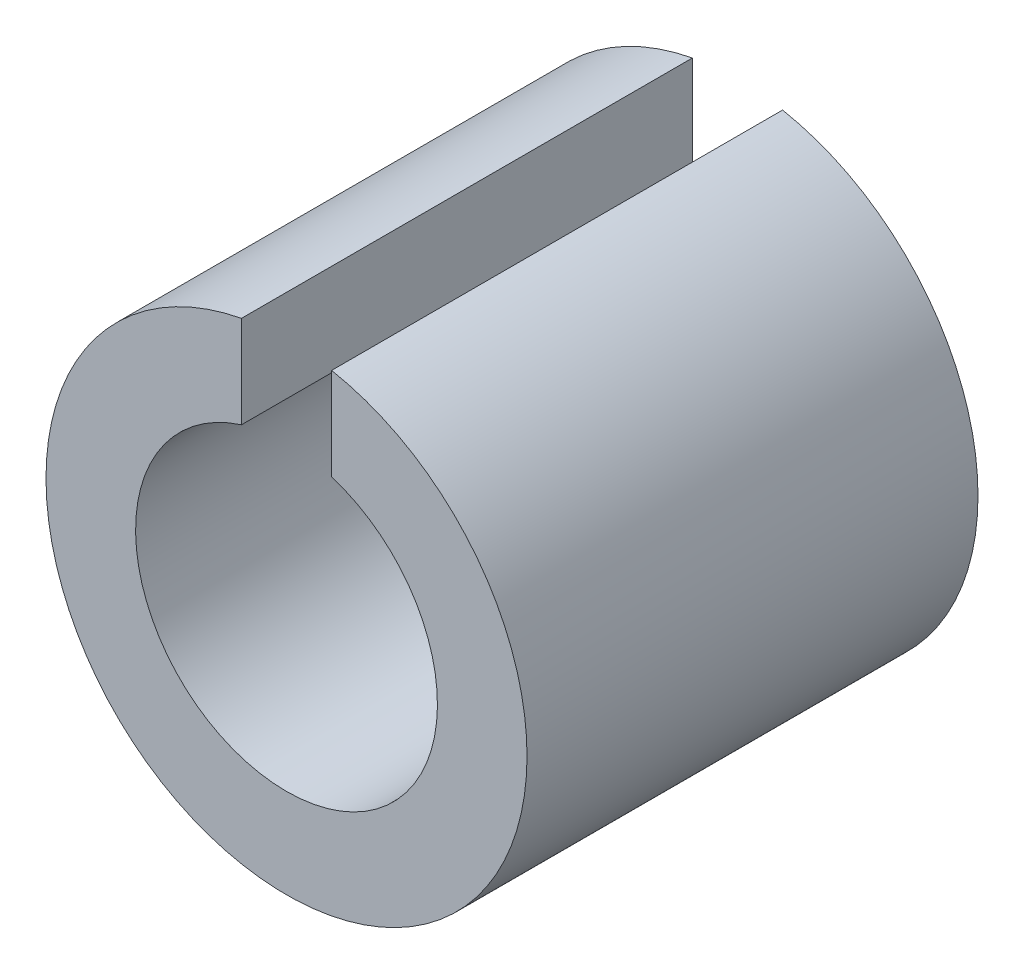
ISO-10303-21;
HEADER;
FILE_DESCRIPTION(('STEP AP214'),'2;1');
FILE_NAME('part.step','',(''),(''),'','','');
FILE_SCHEMA(('AUTOMOTIVE_DESIGN { 1 0 10303 214 1 1 1 1 }'));
ENDSEC;
DATA;
#1=APPLICATION_CONTEXT('core data for automotive mechanical design processes');
#2=APPLICATION_PROTOCOL_DEFINITION('international standard','automotive_design',2000,#1);
#3=PRODUCT_CONTEXT('',#1,'mechanical');
#4=PRODUCT('Part','Part','',(#3));
#5=PRODUCT_RELATED_PRODUCT_CATEGORY('part','',(#4));
#6=PRODUCT_DEFINITION_FORMATION('','',#4);
#7=PRODUCT_DEFINITION_CONTEXT('part definition',#1,'design');
#8=PRODUCT_DEFINITION('design','',#6,#7);
#9=PRODUCT_DEFINITION_SHAPE('','',#8);
#10=(LENGTH_UNIT() NAMED_UNIT(*) SI_UNIT(.MILLI.,.METRE.));
#11=(NAMED_UNIT(*) PLANE_ANGLE_UNIT() SI_UNIT($,.RADIAN.));
#12=(NAMED_UNIT(*) SI_UNIT($,.STERADIAN.) SOLID_ANGLE_UNIT());
#13=UNCERTAINTY_MEASURE_WITH_UNIT(LENGTH_MEASURE(1.E-05),#10,'distance_accuracy_value','');
#14=(GEOMETRIC_REPRESENTATION_CONTEXT(3) GLOBAL_UNCERTAINTY_ASSIGNED_CONTEXT((#13)) GLOBAL_UNIT_ASSIGNED_CONTEXT((#10,
#11,#12)) REPRESENTATION_CONTEXT('',''));
#15=CARTESIAN_POINT('',(0.,0.,0.));
#16=DIRECTION('',(0.,0.,1.));
#17=DIRECTION('',(1.,0.,0.));
#18=AXIS2_PLACEMENT_3D('',#15,#16,#17);
#19=CARTESIAN_POINT('',(0.75,3.92905841137543,3.75));
#20=DIRECTION('',(1.,0.,0.));
#21=DIRECTION('',(0.,1.,0.));
#22=AXIS2_PLACEMENT_3D('',#19,#20,#21);
#23=PLANE('',#22);
#24=DIRECTION('',(0.,0.,-1.));
#25=VECTOR('',#24,1.);
#26=CARTESIAN_POINT('',(0.75,2.39532878745278,3.75));
#27=LINE('',#26,#25);
#28=CARTESIAN_POINT('',(0.75,2.39532878745278,-3.75));
#29=VERTEX_POINT('',#28);
#30=CARTESIAN_POINT('',(0.75,2.39532878745278,3.75));
#31=VERTEX_POINT('',#30);
#32=EDGE_CURVE('E59',#29,#31,#27,.F.);
#33=ORIENTED_EDGE('',*,*,#32,.T.);
#34=DIRECTION('',(0.,1.,0.));
#35=VECTOR('',#34,1.);
#36=CARTESIAN_POINT('',(0.75,3.92905841137543,3.75));
#37=LINE('',#36,#35);
#38=CARTESIAN_POINT('',(0.75,3.92905841137543,3.75));
#39=VERTEX_POINT('',#38);
#40=EDGE_CURVE('E66',#39,#31,#37,.F.);
#41=ORIENTED_EDGE('',*,*,#40,.F.);
#42=DIRECTION('',(0.,0.,-1.));
#43=VECTOR('',#42,1.);
#44=CARTESIAN_POINT('',(0.75,3.92905841137543,3.75));
#45=LINE('',#44,#43);
#46=CARTESIAN_POINT('',(0.75,3.92905841137543,-3.75));
#47=VERTEX_POINT('',#46);
#48=EDGE_CURVE('E64',#47,#39,#45,.F.);
#49=ORIENTED_EDGE('',*,*,#48,.F.);
#50=DIRECTION('',(0.,1.,0.));
#51=VECTOR('',#50,1.);
#52=CARTESIAN_POINT('',(0.75,3.92905841137543,-3.75));
#53=LINE('',#52,#51);
#54=EDGE_CURVE('E34',#29,#47,#53,.T.);
#55=ORIENTED_EDGE('',*,*,#54,.F.);
#56=EDGE_LOOP('',(#33,#41,#49,#55));
#57=FACE_BOUND('',#56,.T.);
#58=ADVANCED_FACE('F16',(#57),#23,.F.);
#59=CARTESIAN_POINT('',(-0.75,2.39532878745278,3.75));
#60=DIRECTION('',(-1.,0.,0.));
#61=DIRECTION('',(0.,-1.,0.));
#62=AXIS2_PLACEMENT_3D('',#59,#60,#61);
#63=PLANE('',#62);
#64=DIRECTION('',(0.,0.,-1.));
#65=VECTOR('',#64,1.);
#66=CARTESIAN_POINT('',(-0.75,3.92905841137543,3.75));
#67=LINE('',#66,#65);
#68=CARTESIAN_POINT('',(-0.75,3.92905841137543,3.75));
#69=VERTEX_POINT('',#68);
#70=CARTESIAN_POINT('',(-0.75,3.92905841137543,-3.75));
#71=VERTEX_POINT('',#70);
#72=EDGE_CURVE('E76',#69,#71,#67,.T.);
#73=ORIENTED_EDGE('',*,*,#72,.F.);
#74=DIRECTION('',(0.,1.,0.));
#75=VECTOR('',#74,1.);
#76=CARTESIAN_POINT('',(-0.75,0.,3.75));
#77=LINE('',#76,#75);
#78=CARTESIAN_POINT('',(-0.75,2.39532878745278,3.75));
#79=VERTEX_POINT('',#78);
#80=EDGE_CURVE('E63',#79,#69,#77,.T.);
#81=ORIENTED_EDGE('',*,*,#80,.F.);
#82=DIRECTION('',(0.,0.,-1.));
#83=VECTOR('',#82,1.);
#84=CARTESIAN_POINT('',(-0.75,2.39532878745278,3.75));
#85=LINE('',#84,#83);
#86=CARTESIAN_POINT('',(-0.75,2.39532878745278,-3.75));
#87=VERTEX_POINT('',#86);
#88=EDGE_CURVE('E54',#79,#87,#85,.T.);
#89=ORIENTED_EDGE('',*,*,#88,.T.);
#90=DIRECTION('',(0.,-1.,0.));
#91=VECTOR('',#90,1.);
#92=CARTESIAN_POINT('',(-0.75,2.39532878745278,-3.75));
#93=LINE('',#92,#91);
#94=EDGE_CURVE('E72',#71,#87,#93,.T.);
#95=ORIENTED_EDGE('',*,*,#94,.F.);
#96=EDGE_LOOP('',(#73,#81,#89,#95));
#97=FACE_BOUND('',#96,.T.);
#98=ADVANCED_FACE('F88',(#97),#63,.F.);
#99=CARTESIAN_POINT('',(0.,0.,3.75));
#100=DIRECTION('',(0.,0.,-1.));
#101=DIRECTION('',(-1.,0.,0.));
#102=AXIS2_PLACEMENT_3D('',#99,#100,#101);
#103=CYLINDRICAL_SURFACE('',#102,2.51);
#104=CARTESIAN_POINT('',(0.,0.,3.75));
#105=DIRECTION('',(0.,0.,-1.));
#106=DIRECTION('',(-1.,0.,0.));
#107=AXIS2_PLACEMENT_3D('',#104,#105,#106);
#108=CIRCLE('',#107,2.51);
#109=EDGE_CURVE('E19',#31,#79,#108,.T.);
#110=ORIENTED_EDGE('',*,*,#109,.F.);
#111=ORIENTED_EDGE('',*,*,#32,.F.);
#112=CARTESIAN_POINT('',(0.,0.,-3.75));
#113=DIRECTION('',(0.,0.,-1.));
#114=DIRECTION('',(-1.,0.,0.));
#115=AXIS2_PLACEMENT_3D('',#112,#113,#114);
#116=CIRCLE('',#115,2.51);
#117=EDGE_CURVE('E78',#29,#87,#116,.T.);
#118=ORIENTED_EDGE('',*,*,#117,.T.);
#119=ORIENTED_EDGE('',*,*,#88,.F.);
#120=EDGE_LOOP('',(#110,#111,#118,#119));
#121=FACE_BOUND('',#120,.T.);
#122=ADVANCED_FACE('F58',(#121),#103,.F.);
#123=CARTESIAN_POINT('',(0.,0.,3.75));
#124=DIRECTION('',(0.,0.,1.));
#125=DIRECTION('',(1.,0.,0.));
#126=AXIS2_PLACEMENT_3D('',#123,#124,#125);
#127=PLANE('',#126);
#128=CARTESIAN_POINT('',(0.,0.,3.75));
#129=DIRECTION('',(0.,0.,-1.));
#130=DIRECTION('',(-1.,0.,0.));
#131=AXIS2_PLACEMENT_3D('',#128,#129,#130);
#132=CIRCLE('',#131,4.);
#133=EDGE_CURVE('E25',#39,#69,#132,.T.);
#134=ORIENTED_EDGE('',*,*,#133,.F.);
#135=ORIENTED_EDGE('',*,*,#40,.T.);
#136=ORIENTED_EDGE('',*,*,#109,.T.);
#137=ORIENTED_EDGE('',*,*,#80,.T.);
#138=EDGE_LOOP('',(#134,#135,#136,#137));
#139=FACE_BOUND('',#138,.T.);
#140=ADVANCED_FACE('F67',(#139),#127,.T.);
#141=CARTESIAN_POINT('',(0.,0.,-3.75));
#142=DIRECTION('',(0.,0.,1.));
#143=DIRECTION('',(1.,0.,0.));
#144=AXIS2_PLACEMENT_3D('',#141,#142,#143);
#145=PLANE('',#144);
#146=ORIENTED_EDGE('',*,*,#54,.T.);
#147=CARTESIAN_POINT('',(0.,0.,-3.75));
#148=DIRECTION('',(0.,0.,-1.));
#149=DIRECTION('',(-1.,0.,0.));
#150=AXIS2_PLACEMENT_3D('',#147,#148,#149);
#151=CIRCLE('',#150,4.);
#152=EDGE_CURVE('E11',#71,#47,#151,.F.);
#153=ORIENTED_EDGE('',*,*,#152,.F.);
#154=ORIENTED_EDGE('',*,*,#94,.T.);
#155=ORIENTED_EDGE('',*,*,#117,.F.);
#156=EDGE_LOOP('',(#146,#153,#154,#155));
#157=FACE_BOUND('',#156,.T.);
#158=ADVANCED_FACE('F85',(#157),#145,.F.);
#159=CARTESIAN_POINT('',(0.,0.,3.75));
#160=DIRECTION('',(0.,0.,-1.));
#161=DIRECTION('',(-1.,0.,0.));
#162=AXIS2_PLACEMENT_3D('',#159,#160,#161);
#163=CYLINDRICAL_SURFACE('',#162,4.);
#164=ORIENTED_EDGE('',*,*,#133,.T.);
#165=ORIENTED_EDGE('',*,*,#72,.T.);
#166=ORIENTED_EDGE('',*,*,#152,.T.);
#167=ORIENTED_EDGE('',*,*,#48,.T.);
#168=EDGE_LOOP('',(#164,#165,#166,#167));
#169=FACE_BOUND('',#168,.T.);
#170=ADVANCED_FACE('F90',(#169),#163,.T.);
#171=CLOSED_SHELL('',(#58,#98,#122,#140,#158,#170));
#172=MANIFOLD_SOLID_BREP('B1',#171);
#173=ADVANCED_BREP_SHAPE_REPRESENTATION('',(#18,#172),#14);
#174=SHAPE_DEFINITION_REPRESENTATION(#9,#173);
ENDSEC;
END-ISO-10303-21;
